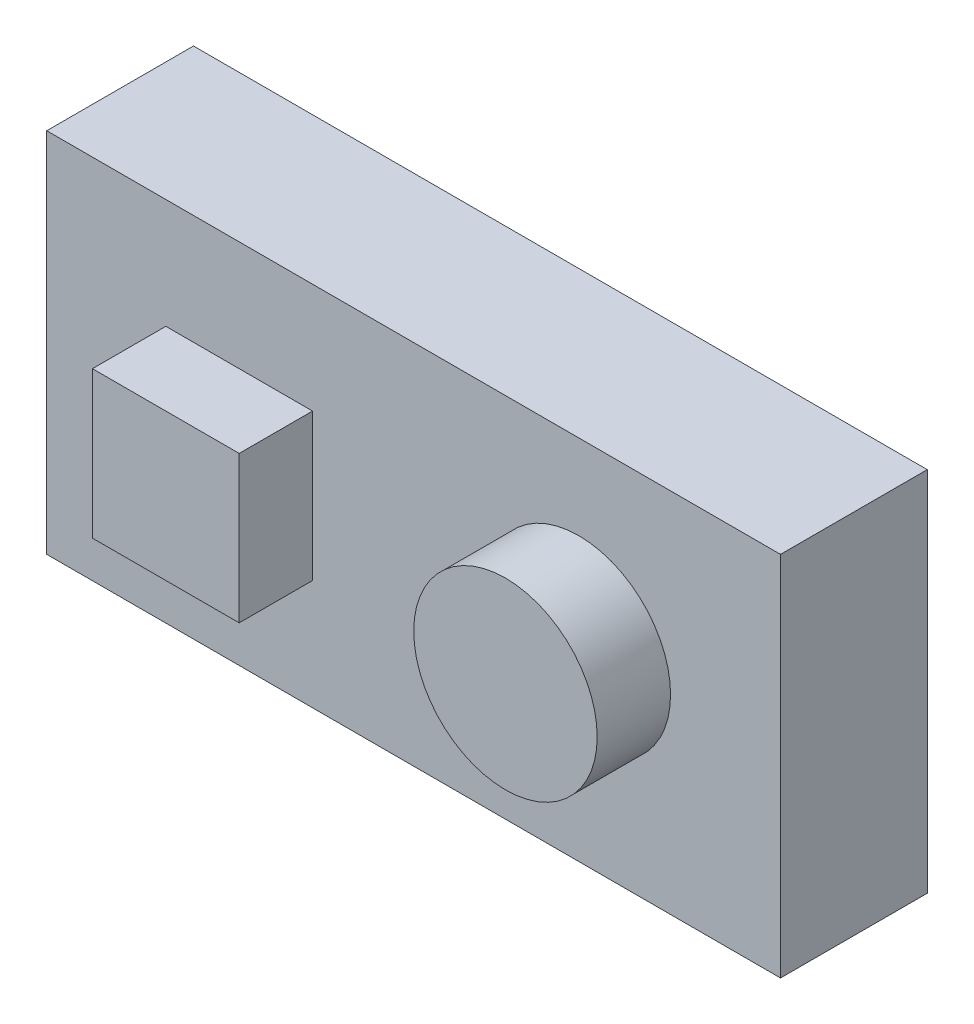
ISO-10303-21;
HEADER;
FILE_DESCRIPTION(('STEP AP214'),'2;1');
FILE_NAME('part.step','',(''),(''),'','','');
FILE_SCHEMA(('AUTOMOTIVE_DESIGN { 1 0 10303 214 1 1 1 1 }'));
ENDSEC;
DATA;
#1=APPLICATION_CONTEXT('core data for automotive mechanical design processes');
#2=APPLICATION_PROTOCOL_DEFINITION('international standard','automotive_design',2000,#1);
#3=PRODUCT_CONTEXT('',#1,'mechanical');
#4=PRODUCT('Part','Part','',(#3));
#5=PRODUCT_RELATED_PRODUCT_CATEGORY('part','',(#4));
#6=PRODUCT_DEFINITION_FORMATION('','',#4);
#7=PRODUCT_DEFINITION_CONTEXT('part definition',#1,'design');
#8=PRODUCT_DEFINITION('design','',#6,#7);
#9=PRODUCT_DEFINITION_SHAPE('','',#8);
#10=(LENGTH_UNIT() NAMED_UNIT(*) SI_UNIT(.MILLI.,.METRE.));
#11=(NAMED_UNIT(*) PLANE_ANGLE_UNIT() SI_UNIT($,.RADIAN.));
#12=(NAMED_UNIT(*) SI_UNIT($,.STERADIAN.) SOLID_ANGLE_UNIT());
#13=UNCERTAINTY_MEASURE_WITH_UNIT(LENGTH_MEASURE(1.E-05),#10,'distance_accuracy_value','');
#14=(GEOMETRIC_REPRESENTATION_CONTEXT(3) GLOBAL_UNCERTAINTY_ASSIGNED_CONTEXT((#13)) GLOBAL_UNIT_ASSIGNED_CONTEXT((#10,
#11,#12)) REPRESENTATION_CONTEXT('',''));
#15=CARTESIAN_POINT('',(0.,0.,0.));
#16=DIRECTION('',(0.,0.,1.));
#17=DIRECTION('',(1.,0.,0.));
#18=AXIS2_PLACEMENT_3D('',#15,#16,#17);
#19=CARTESIAN_POINT('',(0.,0.,20.));
#20=DIRECTION('',(0.,0.,-1.));
#21=DIRECTION('',(-1.,0.,0.));
#22=AXIS2_PLACEMENT_3D('',#19,#20,#21);
#23=PLANE('',#22);
#24=CARTESIAN_POINT('',(72.5158533054634,25.9649651416628,20.));
#25=DIRECTION('',(0.,0.,-1.));
#26=DIRECTION('',(-1.,0.,0.));
#27=AXIS2_PLACEMENT_3D('',#24,#25,#26);
#28=CIRCLE('',#27,12.5);
#29=CARTESIAN_POINT('',(60.0158533054634,25.9649651416628,20.));
#30=VERTEX_POINT('',#29);
#31=EDGE_CURVE('E11',#30,#30,#28,.F.);
#32=ORIENTED_EDGE('',*,*,#31,.F.);
#33=EDGE_LOOP('',(#32));
#34=FACE_BOUND('',#33,.T.);
#35=DIRECTION('',(0.,-1.,0.));
#36=VECTOR('',#35,1.);
#37=CARTESIAN_POINT('',(0.,0.,20.));
#38=LINE('',#37,#36);
#39=CARTESIAN_POINT('',(0.,50.,20.));
#40=VERTEX_POINT('',#39);
#41=CARTESIAN_POINT('',(0.,0.,20.));
#42=VERTEX_POINT('',#41);
#43=EDGE_CURVE('E140',#40,#42,#38,.T.);
#44=ORIENTED_EDGE('',*,*,#43,.T.);
#45=DIRECTION('',(1.,0.,0.));
#46=VECTOR('',#45,1.);
#47=CARTESIAN_POINT('',(0.,0.,20.));
#48=LINE('',#47,#46);
#49=CARTESIAN_POINT('',(100.,0.,20.));
#50=VERTEX_POINT('',#49);
#51=EDGE_CURVE('E144',#42,#50,#48,.T.);
#52=ORIENTED_EDGE('',*,*,#51,.T.);
#53=DIRECTION('',(0.,1.,0.));
#54=VECTOR('',#53,1.);
#55=CARTESIAN_POINT('',(100.,0.,20.));
#56=LINE('',#55,#54);
#57=CARTESIAN_POINT('',(100.,50.,20.));
#58=VERTEX_POINT('',#57);
#59=EDGE_CURVE('E148',#50,#58,#56,.T.);
#60=ORIENTED_EDGE('',*,*,#59,.T.);
#61=DIRECTION('',(-1.,0.,0.));
#62=VECTOR('',#61,1.);
#63=CARTESIAN_POINT('',(0.,50.,20.));
#64=LINE('',#63,#62);
#65=EDGE_CURVE('E151',#58,#40,#64,.T.);
#66=ORIENTED_EDGE('',*,*,#65,.T.);
#67=EDGE_LOOP('',(#44,#52,#60,#66));
#68=FACE_BOUND('',#67,.T.);
#69=DIRECTION('',(0.,-1.,0.));
#70=VECTOR('',#69,1.);
#71=CARTESIAN_POINT('',(16.2262200418049,35.028693536152,20.));
#72=LINE('',#71,#70);
#73=CARTESIAN_POINT('',(16.2262200418049,35.028693536152,20.));
#74=VERTEX_POINT('',#73);
#75=CARTESIAN_POINT('',(16.2262200418049,15.028693536152,20.));
#76=VERTEX_POINT('',#75);
#77=EDGE_CURVE('E127',#74,#76,#72,.T.);
#78=ORIENTED_EDGE('',*,*,#77,.F.);
#79=DIRECTION('',(-1.,0.,0.));
#80=VECTOR('',#79,1.);
#81=CARTESIAN_POINT('',(16.2262200418049,35.028693536152,20.));
#82=LINE('',#81,#80);
#83=CARTESIAN_POINT('',(36.2262200418049,35.028693536152,20.));
#84=VERTEX_POINT('',#83);
#85=EDGE_CURVE('E124',#84,#74,#82,.T.);
#86=ORIENTED_EDGE('',*,*,#85,.F.);
#87=DIRECTION('',(0.,1.,0.));
#88=VECTOR('',#87,1.);
#89=CARTESIAN_POINT('',(36.2262200418049,35.028693536152,20.));
#90=LINE('',#89,#88);
#91=CARTESIAN_POINT('',(36.2262200418049,15.028693536152,20.));
#92=VERTEX_POINT('',#91);
#93=EDGE_CURVE('E60',#92,#84,#90,.T.);
#94=ORIENTED_EDGE('',*,*,#93,.F.);
#95=DIRECTION('',(1.,0.,0.));
#96=VECTOR('',#95,1.);
#97=CARTESIAN_POINT('',(16.2262200418049,15.028693536152,20.));
#98=LINE('',#97,#96);
#99=EDGE_CURVE('E55',#76,#92,#98,.T.);
#100=ORIENTED_EDGE('',*,*,#99,.F.);
#101=EDGE_LOOP('',(#78,#86,#94,#100));
#102=FACE_BOUND('',#101,.T.);
#103=ADVANCED_FACE('F39',(#34,#68,#102),#23,.F.);
#104=CARTESIAN_POINT('',(0.,0.,20.));
#105=DIRECTION('',(1.,0.,0.));
#106=DIRECTION('',(0.,0.,-1.));
#107=AXIS2_PLACEMENT_3D('',#104,#105,#106);
#108=PLANE('',#107);
#109=DIRECTION('',(0.,-1.,0.));
#110=VECTOR('',#109,1.);
#111=CARTESIAN_POINT('',(0.,0.,0.));
#112=LINE('',#111,#110);
#113=CARTESIAN_POINT('',(0.,50.,0.));
#114=VERTEX_POINT('',#113);
#115=CARTESIAN_POINT('',(0.,0.,0.));
#116=VERTEX_POINT('',#115);
#117=EDGE_CURVE('E129',#114,#116,#112,.T.);
#118=ORIENTED_EDGE('',*,*,#117,.T.);
#119=DIRECTION('',(0.,0.,-1.));
#120=VECTOR('',#119,1.);
#121=CARTESIAN_POINT('',(0.,0.,20.));
#122=LINE('',#121,#120);
#123=EDGE_CURVE('E48',#42,#116,#122,.T.);
#124=ORIENTED_EDGE('',*,*,#123,.F.);
#125=ORIENTED_EDGE('',*,*,#43,.F.);
#126=DIRECTION('',(0.,0.,-1.));
#127=VECTOR('',#126,1.);
#128=CARTESIAN_POINT('',(0.,50.,20.));
#129=LINE('',#128,#127);
#130=EDGE_CURVE('E153',#40,#114,#129,.T.);
#131=ORIENTED_EDGE('',*,*,#130,.T.);
#132=EDGE_LOOP('',(#118,#124,#125,#131));
#133=FACE_BOUND('',#132,.T.);
#134=ADVANCED_FACE('F41',(#133),#108,.F.);
#135=CARTESIAN_POINT('',(0.,0.,20.));
#136=DIRECTION('',(0.,1.,0.));
#137=DIRECTION('',(0.,0.,1.));
#138=AXIS2_PLACEMENT_3D('',#135,#136,#137);
#139=PLANE('',#138);
#140=DIRECTION('',(1.,0.,0.));
#141=VECTOR('',#140,1.);
#142=CARTESIAN_POINT('',(0.,0.,0.));
#143=LINE('',#142,#141);
#144=CARTESIAN_POINT('',(100.,0.,0.));
#145=VERTEX_POINT('',#144);
#146=EDGE_CURVE('E134',#116,#145,#143,.T.);
#147=ORIENTED_EDGE('',*,*,#146,.T.);
#148=DIRECTION('',(0.,0.,-1.));
#149=VECTOR('',#148,1.);
#150=CARTESIAN_POINT('',(100.,0.,20.));
#151=LINE('',#150,#149);
#152=EDGE_CURVE('E169',#50,#145,#151,.T.);
#153=ORIENTED_EDGE('',*,*,#152,.F.);
#154=ORIENTED_EDGE('',*,*,#51,.F.);
#155=ORIENTED_EDGE('',*,*,#123,.T.);
#156=EDGE_LOOP('',(#147,#153,#154,#155));
#157=FACE_BOUND('',#156,.T.);
#158=ADVANCED_FACE('F176',(#157),#139,.F.);
#159=CARTESIAN_POINT('',(100.,0.,20.));
#160=DIRECTION('',(-1.,0.,0.));
#161=DIRECTION('',(0.,0.,1.));
#162=AXIS2_PLACEMENT_3D('',#159,#160,#161);
#163=PLANE('',#162);
#164=DIRECTION('',(0.,1.,0.));
#165=VECTOR('',#164,1.);
#166=CARTESIAN_POINT('',(100.,0.,0.));
#167=LINE('',#166,#165);
#168=CARTESIAN_POINT('',(100.,50.,0.));
#169=VERTEX_POINT('',#168);
#170=EDGE_CURVE('E157',#145,#169,#167,.T.);
#171=ORIENTED_EDGE('',*,*,#170,.T.);
#172=DIRECTION('',(0.,0.,-1.));
#173=VECTOR('',#172,1.);
#174=CARTESIAN_POINT('',(100.,50.,20.));
#175=LINE('',#174,#173);
#176=EDGE_CURVE('E165',#58,#169,#175,.T.);
#177=ORIENTED_EDGE('',*,*,#176,.F.);
#178=ORIENTED_EDGE('',*,*,#59,.F.);
#179=ORIENTED_EDGE('',*,*,#152,.T.);
#180=EDGE_LOOP('',(#171,#177,#178,#179));
#181=FACE_BOUND('',#180,.T.);
#182=ADVANCED_FACE('F188',(#181),#163,.F.);
#183=CARTESIAN_POINT('',(0.,50.,20.));
#184=DIRECTION('',(0.,-1.,0.));
#185=DIRECTION('',(0.,0.,-1.));
#186=AXIS2_PLACEMENT_3D('',#183,#184,#185);
#187=PLANE('',#186);
#188=DIRECTION('',(-1.,0.,0.));
#189=VECTOR('',#188,1.);
#190=CARTESIAN_POINT('',(0.,50.,0.));
#191=LINE('',#190,#189);
#192=EDGE_CURVE('E145',#169,#114,#191,.T.);
#193=ORIENTED_EDGE('',*,*,#192,.T.);
#194=ORIENTED_EDGE('',*,*,#130,.F.);
#195=ORIENTED_EDGE('',*,*,#65,.F.);
#196=ORIENTED_EDGE('',*,*,#176,.T.);
#197=EDGE_LOOP('',(#193,#194,#195,#196));
#198=FACE_BOUND('',#197,.T.);
#199=ADVANCED_FACE('F192',(#198),#187,.F.);
#200=CARTESIAN_POINT('',(0.,0.,0.));
#201=DIRECTION('',(0.,0.,-1.));
#202=DIRECTION('',(-1.,0.,0.));
#203=AXIS2_PLACEMENT_3D('',#200,#201,#202);
#204=PLANE('',#203);
#205=ORIENTED_EDGE('',*,*,#117,.F.);
#206=ORIENTED_EDGE('',*,*,#192,.F.);
#207=ORIENTED_EDGE('',*,*,#170,.F.);
#208=ORIENTED_EDGE('',*,*,#146,.F.);
#209=EDGE_LOOP('',(#205,#206,#207,#208));
#210=FACE_BOUND('',#209,.T.);
#211=ADVANCED_FACE('F184',(#210),#204,.T.);
#212=CARTESIAN_POINT('',(16.2262200418049,35.028693536152,30.));
#213=DIRECTION('',(1.,0.,0.));
#214=DIRECTION('',(0.,0.,-1.));
#215=AXIS2_PLACEMENT_3D('',#212,#213,#214);
#216=PLANE('',#215);
#217=ORIENTED_EDGE('',*,*,#77,.T.);
#218=DIRECTION('',(0.,0.,-1.));
#219=VECTOR('',#218,1.);
#220=CARTESIAN_POINT('',(16.2262200418049,15.028693536152,30.));
#221=LINE('',#220,#219);
#222=CARTESIAN_POINT('',(16.2262200418049,15.028693536152,30.));
#223=VERTEX_POINT('',#222);
#224=EDGE_CURVE('E106',#223,#76,#221,.T.);
#225=ORIENTED_EDGE('',*,*,#224,.F.);
#226=DIRECTION('',(0.,-1.,0.));
#227=VECTOR('',#226,1.);
#228=CARTESIAN_POINT('',(16.2262200418049,35.028693536152,30.));
#229=LINE('',#228,#227);
#230=CARTESIAN_POINT('',(16.2262200418049,35.028693536152,30.));
#231=VERTEX_POINT('',#230);
#232=EDGE_CURVE('E114',#231,#223,#229,.T.);
#233=ORIENTED_EDGE('',*,*,#232,.F.);
#234=DIRECTION('',(0.,0.,-1.));
#235=VECTOR('',#234,1.);
#236=CARTESIAN_POINT('',(16.2262200418049,35.028693536152,30.));
#237=LINE('',#236,#235);
#238=EDGE_CURVE('E204',#231,#74,#237,.T.);
#239=ORIENTED_EDGE('',*,*,#238,.T.);
#240=EDGE_LOOP('',(#217,#225,#233,#239));
#241=FACE_BOUND('',#240,.T.);
#242=ADVANCED_FACE('F126',(#241),#216,.F.);
#243=CARTESIAN_POINT('',(16.2262200418049,15.028693536152,30.));
#244=DIRECTION('',(0.,1.,0.));
#245=DIRECTION('',(0.,0.,1.));
#246=AXIS2_PLACEMENT_3D('',#243,#244,#245);
#247=PLANE('',#246);
#248=ORIENTED_EDGE('',*,*,#99,.T.);
#249=DIRECTION('',(0.,0.,-1.));
#250=VECTOR('',#249,1.);
#251=CARTESIAN_POINT('',(36.2262200418049,15.028693536152,30.));
#252=LINE('',#251,#250);
#253=CARTESIAN_POINT('',(36.2262200418049,15.028693536152,30.));
#254=VERTEX_POINT('',#253);
#255=EDGE_CURVE('E109',#254,#92,#252,.T.);
#256=ORIENTED_EDGE('',*,*,#255,.F.);
#257=DIRECTION('',(1.,0.,0.));
#258=VECTOR('',#257,1.);
#259=CARTESIAN_POINT('',(16.2262200418049,15.028693536152,30.));
#260=LINE('',#259,#258);
#261=EDGE_CURVE('E102',#223,#254,#260,.T.);
#262=ORIENTED_EDGE('',*,*,#261,.F.);
#263=ORIENTED_EDGE('',*,*,#224,.T.);
#264=EDGE_LOOP('',(#248,#256,#262,#263));
#265=FACE_BOUND('',#264,.T.);
#266=ADVANCED_FACE('F104',(#265),#247,.F.);
#267=CARTESIAN_POINT('',(36.2262200418049,35.028693536152,30.));
#268=DIRECTION('',(-1.,0.,0.));
#269=DIRECTION('',(0.,-1.,0.));
#270=AXIS2_PLACEMENT_3D('',#267,#268,#269);
#271=PLANE('',#270);
#272=ORIENTED_EDGE('',*,*,#93,.T.);
#273=DIRECTION('',(0.,0.,-1.));
#274=VECTOR('',#273,1.);
#275=CARTESIAN_POINT('',(36.2262200418049,35.028693536152,30.));
#276=LINE('',#275,#274);
#277=CARTESIAN_POINT('',(36.2262200418049,35.028693536152,30.));
#278=VERTEX_POINT('',#277);
#279=EDGE_CURVE('E136',#278,#84,#276,.T.);
#280=ORIENTED_EDGE('',*,*,#279,.F.);
#281=DIRECTION('',(0.,1.,0.));
#282=VECTOR('',#281,1.);
#283=CARTESIAN_POINT('',(36.2262200418049,35.028693536152,30.));
#284=LINE('',#283,#282);
#285=EDGE_CURVE('E113',#254,#278,#284,.T.);
#286=ORIENTED_EDGE('',*,*,#285,.F.);
#287=ORIENTED_EDGE('',*,*,#255,.T.);
#288=EDGE_LOOP('',(#272,#280,#286,#287));
#289=FACE_BOUND('',#288,.T.);
#290=ADVANCED_FACE('F240',(#289),#271,.F.);
#291=CARTESIAN_POINT('',(16.2262200418049,35.028693536152,30.));
#292=DIRECTION('',(0.,-1.,0.));
#293=DIRECTION('',(0.,0.,-1.));
#294=AXIS2_PLACEMENT_3D('',#291,#292,#293);
#295=PLANE('',#294);
#296=ORIENTED_EDGE('',*,*,#85,.T.);
#297=ORIENTED_EDGE('',*,*,#238,.F.);
#298=DIRECTION('',(-1.,0.,0.));
#299=VECTOR('',#298,1.);
#300=CARTESIAN_POINT('',(16.2262200418049,35.028693536152,30.));
#301=LINE('',#300,#299);
#302=EDGE_CURVE('E119',#278,#231,#301,.T.);
#303=ORIENTED_EDGE('',*,*,#302,.F.);
#304=ORIENTED_EDGE('',*,*,#279,.T.);
#305=EDGE_LOOP('',(#296,#297,#303,#304));
#306=FACE_BOUND('',#305,.T.);
#307=ADVANCED_FACE('F203',(#306),#295,.F.);
#308=CARTESIAN_POINT('',(0.,0.,30.));
#309=DIRECTION('',(0.,0.,1.));
#310=DIRECTION('',(1.,0.,0.));
#311=AXIS2_PLACEMENT_3D('',#308,#309,#310);
#312=PLANE('',#311);
#313=ORIENTED_EDGE('',*,*,#232,.T.);
#314=ORIENTED_EDGE('',*,*,#261,.T.);
#315=ORIENTED_EDGE('',*,*,#285,.T.);
#316=ORIENTED_EDGE('',*,*,#302,.T.);
#317=EDGE_LOOP('',(#313,#314,#315,#316));
#318=FACE_BOUND('',#317,.T.);
#319=ADVANCED_FACE('F117',(#318),#312,.T.);
#320=CARTESIAN_POINT('',(72.5158533054634,25.9649651416628,30.));
#321=DIRECTION('',(0.,0.,-1.));
#322=DIRECTION('',(-1.,0.,0.));
#323=AXIS2_PLACEMENT_3D('',#320,#321,#322);
#324=CYLINDRICAL_SURFACE('',#323,12.5);
#325=CARTESIAN_POINT('',(72.5158533054634,25.9649651416628,30.));
#326=DIRECTION('',(0.,0.,1.));
#327=DIRECTION('',(1.,0.,0.));
#328=AXIS2_PLACEMENT_3D('',#325,#326,#327);
#329=CIRCLE('',#328,12.5);
#330=CARTESIAN_POINT('',(85.0158533054634,25.9649651416628,30.));
#331=VERTEX_POINT('',#330);
#332=EDGE_CURVE('E199',#331,#331,#329,.T.);
#333=ORIENTED_EDGE('',*,*,#332,.F.);
#334=EDGE_LOOP('',(#333));
#335=FACE_BOUND('',#334,.T.);
#336=ORIENTED_EDGE('',*,*,#31,.T.);
#337=EDGE_LOOP('',(#336));
#338=FACE_BOUND('',#337,.T.);
#339=ADVANCED_FACE('F226',(#335,#338),#324,.T.);
#340=CARTESIAN_POINT('',(72.5158533054634,25.9649651416628,30.));
#341=DIRECTION('',(0.,0.,1.));
#342=DIRECTION('',(1.,0.,0.));
#343=AXIS2_PLACEMENT_3D('',#340,#341,#342);
#344=PLANE('',#343);
#345=ORIENTED_EDGE('',*,*,#332,.T.);
#346=EDGE_LOOP('',(#345));
#347=FACE_BOUND('',#346,.T.);
#348=ADVANCED_FACE('F224',(#347),#344,.T.);
#349=CLOSED_SHELL('',(#103,#134,#158,#182,#199,#211,#242,#266,#290,#307,#319,#339,#348));
#350=MANIFOLD_SOLID_BREP('B2',#349);
#351=ADVANCED_BREP_SHAPE_REPRESENTATION('',(#18,#350),#14);
#352=SHAPE_DEFINITION_REPRESENTATION(#9,#351);
ENDSEC;
END-ISO-10303-21;
